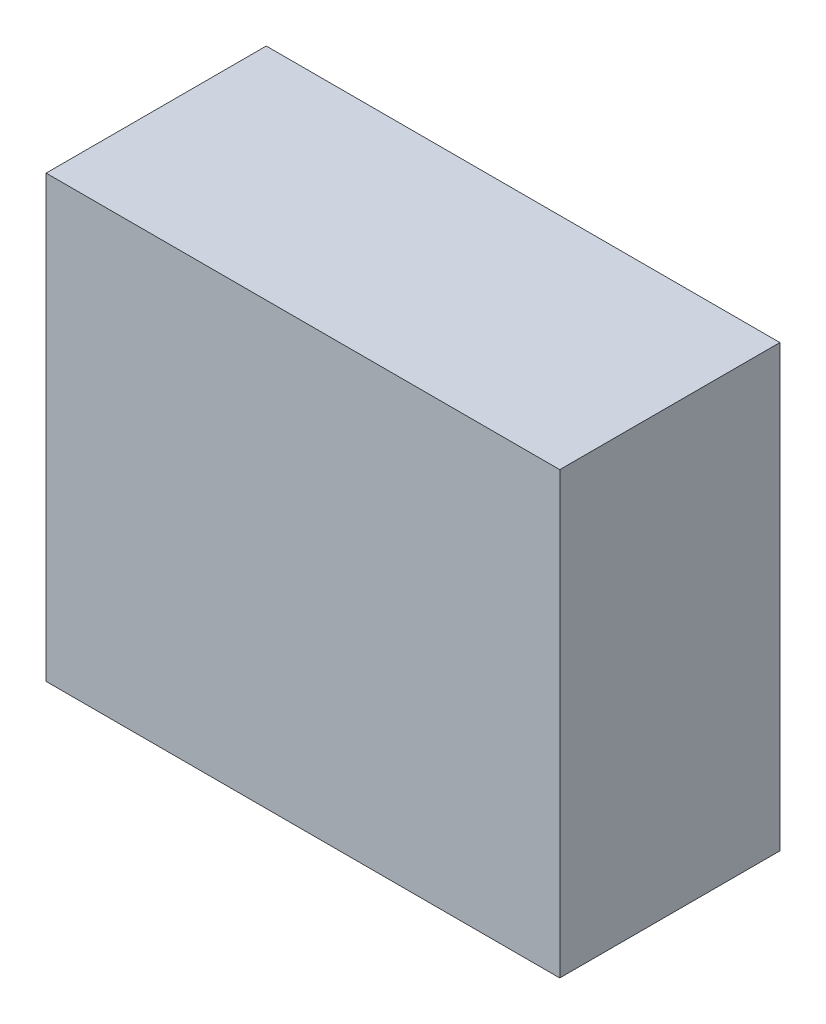
ISO-10303-21;
HEADER;
FILE_DESCRIPTION(('STEP AP214'),'2;1');
FILE_NAME('part.step','',(''),(''),'','','');
FILE_SCHEMA(('AUTOMOTIVE_DESIGN { 1 0 10303 214 1 1 1 1 }'));
ENDSEC;
DATA;
#1=APPLICATION_CONTEXT('core data for automotive mechanical design processes');
#2=APPLICATION_PROTOCOL_DEFINITION('international standard','automotive_design',2000,#1);
#3=PRODUCT_CONTEXT('',#1,'mechanical');
#4=PRODUCT('Part','Part','',(#3));
#5=PRODUCT_RELATED_PRODUCT_CATEGORY('part','',(#4));
#6=PRODUCT_DEFINITION_FORMATION('','',#4);
#7=PRODUCT_DEFINITION_CONTEXT('part definition',#1,'design');
#8=PRODUCT_DEFINITION('design','',#6,#7);
#9=PRODUCT_DEFINITION_SHAPE('','',#8);
#10=(LENGTH_UNIT() NAMED_UNIT(*) SI_UNIT(.MILLI.,.METRE.));
#11=(NAMED_UNIT(*) PLANE_ANGLE_UNIT() SI_UNIT($,.RADIAN.));
#12=(NAMED_UNIT(*) SI_UNIT($,.STERADIAN.) SOLID_ANGLE_UNIT());
#13=UNCERTAINTY_MEASURE_WITH_UNIT(LENGTH_MEASURE(1.E-05),#10,'distance_accuracy_value','');
#14=(GEOMETRIC_REPRESENTATION_CONTEXT(3) GLOBAL_UNCERTAINTY_ASSIGNED_CONTEXT((#13)) GLOBAL_UNIT_ASSIGNED_CONTEXT((#10,
#11,#12)) REPRESENTATION_CONTEXT('',''));
#15=CARTESIAN_POINT('',(0.,0.,0.));
#16=DIRECTION('',(0.,0.,1.));
#17=DIRECTION('',(1.,0.,0.));
#18=AXIS2_PLACEMENT_3D('',#15,#16,#17);
#19=CARTESIAN_POINT('',(88.9,152.4,38.1));
#20=DIRECTION('',(-1.,0.,0.));
#21=DIRECTION('',(0.,0.,1.));
#22=AXIS2_PLACEMENT_3D('',#19,#20,#21);
#23=PLANE('',#22);
#24=DIRECTION('',(0.,0.,-1.));
#25=VECTOR('',#24,1.);
#26=CARTESIAN_POINT('',(88.9,0.,38.1));
#27=LINE('',#26,#25);
#28=CARTESIAN_POINT('',(88.9,0.,38.1));
#29=VERTEX_POINT('',#28);
#30=CARTESIAN_POINT('',(88.9,0.,-38.1));
#31=VERTEX_POINT('',#30);
#32=EDGE_CURVE('E113',#29,#31,#27,.T.);
#33=ORIENTED_EDGE('',*,*,#32,.T.);
#34=DIRECTION('',(0.,-1.,0.));
#35=VECTOR('',#34,1.);
#36=CARTESIAN_POINT('',(88.9,152.4,-38.1));
#37=LINE('',#36,#35);
#38=CARTESIAN_POINT('',(88.9,152.4,-38.1));
#39=VERTEX_POINT('',#38);
#40=EDGE_CURVE('E11',#39,#31,#37,.T.);
#41=ORIENTED_EDGE('',*,*,#40,.F.);
#42=DIRECTION('',(0.,0.,-1.));
#43=VECTOR('',#42,1.);
#44=CARTESIAN_POINT('',(88.9,152.4,38.1));
#45=LINE('',#44,#43);
#46=CARTESIAN_POINT('',(88.9,152.4,38.1));
#47=VERTEX_POINT('',#46);
#48=EDGE_CURVE('E97',#47,#39,#45,.T.);
#49=ORIENTED_EDGE('',*,*,#48,.F.);
#50=DIRECTION('',(0.,-1.,0.));
#51=VECTOR('',#50,1.);
#52=CARTESIAN_POINT('',(88.9,152.4,38.1));
#53=LINE('',#52,#51);
#54=EDGE_CURVE('E109',#47,#29,#53,.T.);
#55=ORIENTED_EDGE('',*,*,#54,.T.);
#56=EDGE_LOOP('',(#33,#41,#49,#55));
#57=FACE_BOUND('',#56,.T.);
#58=ADVANCED_FACE('F45',(#57),#23,.F.);
#59=CARTESIAN_POINT('',(-88.9,152.4,-38.1));
#60=DIRECTION('',(0.,0.,1.));
#61=DIRECTION('',(1.,0.,0.));
#62=AXIS2_PLACEMENT_3D('',#59,#60,#61);
#63=PLANE('',#62);
#64=DIRECTION('',(-1.,0.,0.));
#65=VECTOR('',#64,1.);
#66=CARTESIAN_POINT('',(-88.9,0.,-38.1));
#67=LINE('',#66,#65);
#68=CARTESIAN_POINT('',(-88.9,0.,-38.1));
#69=VERTEX_POINT('',#68);
#70=EDGE_CURVE('E102',#31,#69,#67,.T.);
#71=ORIENTED_EDGE('',*,*,#70,.T.);
#72=DIRECTION('',(0.,-1.,0.));
#73=VECTOR('',#72,1.);
#74=CARTESIAN_POINT('',(-88.9,152.4,-38.1));
#75=LINE('',#74,#73);
#76=CARTESIAN_POINT('',(-88.9,152.4,-38.1));
#77=VERTEX_POINT('',#76);
#78=EDGE_CURVE('E54',#77,#69,#75,.T.);
#79=ORIENTED_EDGE('',*,*,#78,.F.);
#80=DIRECTION('',(-1.,0.,0.));
#81=VECTOR('',#80,1.);
#82=CARTESIAN_POINT('',(-88.9,152.4,-38.1));
#83=LINE('',#82,#81);
#84=EDGE_CURVE('E92',#39,#77,#83,.T.);
#85=ORIENTED_EDGE('',*,*,#84,.F.);
#86=ORIENTED_EDGE('',*,*,#40,.T.);
#87=EDGE_LOOP('',(#71,#79,#85,#86));
#88=FACE_BOUND('',#87,.T.);
#89=ADVANCED_FACE('F101',(#88),#63,.F.);
#90=CARTESIAN_POINT('',(-88.9,152.4,38.1));
#91=DIRECTION('',(1.,0.,0.));
#92=DIRECTION('',(0.,0.,-1.));
#93=AXIS2_PLACEMENT_3D('',#90,#91,#92);
#94=PLANE('',#93);
#95=DIRECTION('',(0.,0.,1.));
#96=VECTOR('',#95,1.);
#97=CARTESIAN_POINT('',(-88.9,0.,38.1));
#98=LINE('',#97,#96);
#99=CARTESIAN_POINT('',(-88.9,0.,38.1));
#100=VERTEX_POINT('',#99);
#101=EDGE_CURVE('E79',#69,#100,#98,.T.);
#102=ORIENTED_EDGE('',*,*,#101,.T.);
#103=DIRECTION('',(0.,-1.,0.));
#104=VECTOR('',#103,1.);
#105=CARTESIAN_POINT('',(-88.9,152.4,38.1));
#106=LINE('',#105,#104);
#107=CARTESIAN_POINT('',(-88.9,152.4,38.1));
#108=VERTEX_POINT('',#107);
#109=EDGE_CURVE('E104',#108,#100,#106,.T.);
#110=ORIENTED_EDGE('',*,*,#109,.F.);
#111=DIRECTION('',(0.,0.,1.));
#112=VECTOR('',#111,1.);
#113=CARTESIAN_POINT('',(-88.9,152.4,38.1));
#114=LINE('',#113,#112);
#115=EDGE_CURVE('E95',#77,#108,#114,.T.);
#116=ORIENTED_EDGE('',*,*,#115,.F.);
#117=ORIENTED_EDGE('',*,*,#78,.T.);
#118=EDGE_LOOP('',(#102,#110,#116,#117));
#119=FACE_BOUND('',#118,.T.);
#120=ADVANCED_FACE('F105',(#119),#94,.F.);
#121=CARTESIAN_POINT('',(-88.9,152.4,38.1));
#122=DIRECTION('',(0.,0.,-1.));
#123=DIRECTION('',(-1.,0.,0.));
#124=AXIS2_PLACEMENT_3D('',#121,#122,#123);
#125=PLANE('',#124);
#126=DIRECTION('',(1.,0.,0.));
#127=VECTOR('',#126,1.);
#128=CARTESIAN_POINT('',(-88.9,0.,38.1));
#129=LINE('',#128,#127);
#130=EDGE_CURVE('E85',#100,#29,#129,.T.);
#131=ORIENTED_EDGE('',*,*,#130,.T.);
#132=ORIENTED_EDGE('',*,*,#54,.F.);
#133=DIRECTION('',(1.,0.,0.));
#134=VECTOR('',#133,1.);
#135=CARTESIAN_POINT('',(-88.9,152.4,38.1));
#136=LINE('',#135,#134);
#137=EDGE_CURVE('E62',#108,#47,#136,.T.);
#138=ORIENTED_EDGE('',*,*,#137,.F.);
#139=ORIENTED_EDGE('',*,*,#109,.T.);
#140=EDGE_LOOP('',(#131,#132,#138,#139));
#141=FACE_BOUND('',#140,.T.);
#142=ADVANCED_FACE('F126',(#141),#125,.F.);
#143=CARTESIAN_POINT('',(0.,152.4,0.));
#144=DIRECTION('',(0.,-1.,0.));
#145=DIRECTION('',(0.,0.,-1.));
#146=AXIS2_PLACEMENT_3D('',#143,#144,#145);
#147=PLANE('',#146);
#148=ORIENTED_EDGE('',*,*,#48,.T.);
#149=ORIENTED_EDGE('',*,*,#84,.T.);
#150=ORIENTED_EDGE('',*,*,#115,.T.);
#151=ORIENTED_EDGE('',*,*,#137,.T.);
#152=EDGE_LOOP('',(#148,#149,#150,#151));
#153=FACE_BOUND('',#152,.T.);
#154=ADVANCED_FACE('F93',(#153),#147,.F.);
#155=CARTESIAN_POINT('',(0.,0.,0.));
#156=DIRECTION('',(0.,-1.,0.));
#157=DIRECTION('',(0.,0.,-1.));
#158=AXIS2_PLACEMENT_3D('',#155,#156,#157);
#159=PLANE('',#158);
#160=ORIENTED_EDGE('',*,*,#32,.F.);
#161=ORIENTED_EDGE('',*,*,#130,.F.);
#162=ORIENTED_EDGE('',*,*,#101,.F.);
#163=ORIENTED_EDGE('',*,*,#70,.F.);
#164=EDGE_LOOP('',(#160,#161,#162,#163));
#165=FACE_BOUND('',#164,.T.);
#166=ADVANCED_FACE('F129',(#165),#159,.T.);
#167=CLOSED_SHELL('',(#58,#89,#120,#142,#154,#166));
#168=MANIFOLD_SOLID_BREP('B2',#167);
#169=ADVANCED_BREP_SHAPE_REPRESENTATION('',(#18,#168),#14);
#170=SHAPE_DEFINITION_REPRESENTATION(#9,#169);
ENDSEC;
END-ISO-10303-21;
